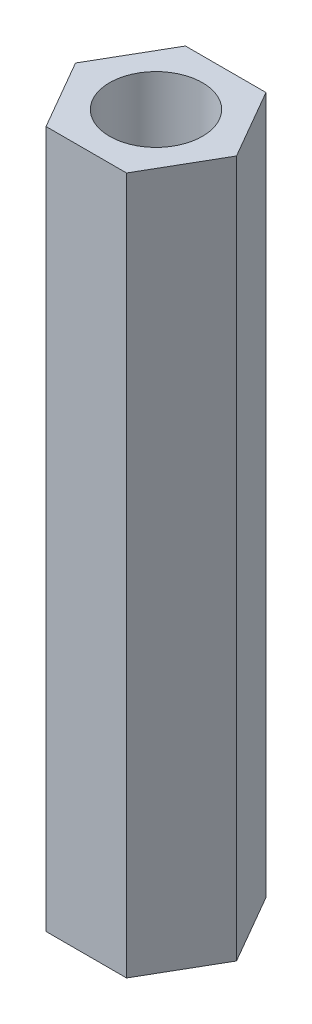
ISO-10303-21;
HEADER;
FILE_DESCRIPTION(('STEP AP214'),'2;1');
FILE_NAME('part.step','',(''),(''),'','','');
FILE_SCHEMA(('AUTOMOTIVE_DESIGN { 1 0 10303 214 1 1 1 1 }'));
ENDSEC;
DATA;
#1=APPLICATION_CONTEXT('core data for automotive mechanical design processes');
#2=APPLICATION_PROTOCOL_DEFINITION('international standard','automotive_design',2000,#1);
#3=PRODUCT_CONTEXT('',#1,'mechanical');
#4=PRODUCT('Part','Part','',(#3));
#5=PRODUCT_RELATED_PRODUCT_CATEGORY('part','',(#4));
#6=PRODUCT_DEFINITION_FORMATION('','',#4);
#7=PRODUCT_DEFINITION_CONTEXT('part definition',#1,'design');
#8=PRODUCT_DEFINITION('design','',#6,#7);
#9=PRODUCT_DEFINITION_SHAPE('','',#8);
#10=(LENGTH_UNIT() NAMED_UNIT(*) SI_UNIT(.MILLI.,.METRE.));
#11=(NAMED_UNIT(*) PLANE_ANGLE_UNIT() SI_UNIT($,.RADIAN.));
#12=(NAMED_UNIT(*) SI_UNIT($,.STERADIAN.) SOLID_ANGLE_UNIT());
#13=UNCERTAINTY_MEASURE_WITH_UNIT(LENGTH_MEASURE(1.E-05),#10,'distance_accuracy_value','');
#14=(GEOMETRIC_REPRESENTATION_CONTEXT(3) GLOBAL_UNCERTAINTY_ASSIGNED_CONTEXT((#13)) GLOBAL_UNIT_ASSIGNED_CONTEXT((#10,
#11,#12)) REPRESENTATION_CONTEXT('',''));
#15=CARTESIAN_POINT('',(0.,0.,0.));
#16=DIRECTION('',(0.,0.,1.));
#17=DIRECTION('',(1.,0.,0.));
#18=AXIS2_PLACEMENT_3D('',#15,#16,#17);
#19=CARTESIAN_POINT('',(0.,30.,0.));
#20=DIRECTION('',(0.,1.,0.));
#21=DIRECTION('',(0.,0.,1.));
#22=AXIS2_PLACEMENT_3D('',#19,#20,#21);
#23=PLANE('',#22);
#24=DIRECTION('',(-0.5,0.,-0.866025403784438));
#25=VECTOR('',#24,1.);
#26=CARTESIAN_POINT('',(3.46410161513775,30.,0.));
#27=LINE('',#26,#25);
#28=CARTESIAN_POINT('',(3.46410161513775,30.,0.));
#29=VERTEX_POINT('',#28);
#30=CARTESIAN_POINT('',(1.73205080756888,30.,-3.));
#31=VERTEX_POINT('',#30);
#32=EDGE_CURVE('E133',#29,#31,#27,.T.);
#33=ORIENTED_EDGE('',*,*,#32,.T.);
#34=DIRECTION('',(-1.,0.,0.));
#35=VECTOR('',#34,1.);
#36=CARTESIAN_POINT('',(1.73205080756888,30.,-3.));
#37=LINE('',#36,#35);
#38=CARTESIAN_POINT('',(-1.73205080756888,30.,-3.));
#39=VERTEX_POINT('',#38);
#40=EDGE_CURVE('E91',#31,#39,#37,.T.);
#41=ORIENTED_EDGE('',*,*,#40,.T.);
#42=DIRECTION('',(-0.499999999999999,0.,0.866025403784439));
#43=VECTOR('',#42,1.);
#44=CARTESIAN_POINT('',(-1.73205080756888,30.,-3.));
#45=LINE('',#44,#43);
#46=CARTESIAN_POINT('',(-3.46410161513775,30.,0.));
#47=VERTEX_POINT('',#46);
#48=EDGE_CURVE('E104',#39,#47,#45,.T.);
#49=ORIENTED_EDGE('',*,*,#48,.T.);
#50=DIRECTION('',(0.5,0.,0.866025403784438));
#51=VECTOR('',#50,1.);
#52=CARTESIAN_POINT('',(-3.46410161513775,30.,0.));
#53=LINE('',#52,#51);
#54=CARTESIAN_POINT('',(-1.73205080756888,30.,3.));
#55=VERTEX_POINT('',#54);
#56=EDGE_CURVE('E98',#47,#55,#53,.T.);
#57=ORIENTED_EDGE('',*,*,#56,.T.);
#58=DIRECTION('',(1.,0.,0.));
#59=VECTOR('',#58,1.);
#60=CARTESIAN_POINT('',(-1.73205080756888,30.,3.));
#61=LINE('',#60,#59);
#62=CARTESIAN_POINT('',(1.73205080756888,30.,3.));
#63=VERTEX_POINT('',#62);
#64=EDGE_CURVE('E102',#55,#63,#61,.T.);
#65=ORIENTED_EDGE('',*,*,#64,.T.);
#66=DIRECTION('',(0.5,0.,-0.866025403784439));
#67=VECTOR('',#66,1.);
#68=CARTESIAN_POINT('',(1.73205080756888,30.,3.));
#69=LINE('',#68,#67);
#70=EDGE_CURVE('E54',#63,#29,#69,.T.);
#71=ORIENTED_EDGE('',*,*,#70,.T.);
#72=EDGE_LOOP('',(#33,#41,#49,#57,#65,#71));
#73=FACE_BOUND('',#72,.T.);
#74=CARTESIAN_POINT('',(0.,30.,0.));
#75=DIRECTION('',(0.,1.,0.));
#76=DIRECTION('',(0.,0.,1.));
#77=AXIS2_PLACEMENT_3D('',#74,#75,#76);
#78=CIRCLE('',#77,2.);
#79=CARTESIAN_POINT('',(0.,30.,2.));
#80=VERTEX_POINT('',#79);
#81=EDGE_CURVE('E126',#80,#80,#78,.T.);
#82=ORIENTED_EDGE('',*,*,#81,.F.);
#83=EDGE_LOOP('',(#82));
#84=FACE_BOUND('',#83,.T.);
#85=ADVANCED_FACE('F37',(#73,#84),#23,.T.);
#86=CARTESIAN_POINT('',(0.,0.,0.));
#87=DIRECTION('',(0.,1.,0.));
#88=DIRECTION('',(0.,0.,1.));
#89=AXIS2_PLACEMENT_3D('',#86,#87,#88);
#90=PLANE('',#89);
#91=DIRECTION('',(-0.5,0.,-0.866025403784438));
#92=VECTOR('',#91,1.);
#93=CARTESIAN_POINT('',(3.46410161513775,0.,0.));
#94=LINE('',#93,#92);
#95=CARTESIAN_POINT('',(3.46410161513775,0.,0.));
#96=VERTEX_POINT('',#95);
#97=CARTESIAN_POINT('',(1.73205080756888,0.,-3.));
#98=VERTEX_POINT('',#97);
#99=EDGE_CURVE('E122',#96,#98,#94,.T.);
#100=ORIENTED_EDGE('',*,*,#99,.F.);
#101=DIRECTION('',(0.5,0.,-0.866025403784439));
#102=VECTOR('',#101,1.);
#103=CARTESIAN_POINT('',(1.73205080756888,0.,3.));
#104=LINE('',#103,#102);
#105=CARTESIAN_POINT('',(1.73205080756888,0.,3.));
#106=VERTEX_POINT('',#105);
#107=EDGE_CURVE('E83',#106,#96,#104,.T.);
#108=ORIENTED_EDGE('',*,*,#107,.F.);
#109=DIRECTION('',(1.,0.,0.));
#110=VECTOR('',#109,1.);
#111=CARTESIAN_POINT('',(-1.73205080756888,0.,3.));
#112=LINE('',#111,#110);
#113=CARTESIAN_POINT('',(-1.73205080756888,0.,3.));
#114=VERTEX_POINT('',#113);
#115=EDGE_CURVE('E77',#114,#106,#112,.T.);
#116=ORIENTED_EDGE('',*,*,#115,.F.);
#117=DIRECTION('',(0.5,0.,0.866025403784438));
#118=VECTOR('',#117,1.);
#119=CARTESIAN_POINT('',(-3.46410161513775,0.,0.));
#120=LINE('',#119,#118);
#121=CARTESIAN_POINT('',(-3.46410161513775,0.,0.));
#122=VERTEX_POINT('',#121);
#123=EDGE_CURVE('E112',#122,#114,#120,.T.);
#124=ORIENTED_EDGE('',*,*,#123,.F.);
#125=DIRECTION('',(-0.499999999999999,0.,0.866025403784439));
#126=VECTOR('',#125,1.);
#127=CARTESIAN_POINT('',(-1.73205080756888,0.,-3.));
#128=LINE('',#127,#126);
#129=CARTESIAN_POINT('',(-1.73205080756888,0.,-3.));
#130=VERTEX_POINT('',#129);
#131=EDGE_CURVE('E128',#130,#122,#128,.T.);
#132=ORIENTED_EDGE('',*,*,#131,.F.);
#133=DIRECTION('',(-1.,0.,0.));
#134=VECTOR('',#133,1.);
#135=CARTESIAN_POINT('',(1.73205080756888,0.,-3.));
#136=LINE('',#135,#134);
#137=EDGE_CURVE('E125',#98,#130,#136,.T.);
#138=ORIENTED_EDGE('',*,*,#137,.F.);
#139=EDGE_LOOP('',(#100,#108,#116,#124,#132,#138));
#140=FACE_BOUND('',#139,.T.);
#141=CARTESIAN_POINT('',(0.,0.,0.));
#142=DIRECTION('',(0.,1.,0.));
#143=DIRECTION('',(0.,0.,1.));
#144=AXIS2_PLACEMENT_3D('',#141,#142,#143);
#145=CIRCLE('',#144,2.);
#146=CARTESIAN_POINT('',(0.,0.,2.));
#147=VERTEX_POINT('',#146);
#148=EDGE_CURVE('E226',#147,#147,#145,.T.);
#149=ORIENTED_EDGE('',*,*,#148,.T.);
#150=EDGE_LOOP('',(#149));
#151=FACE_BOUND('',#150,.T.);
#152=ADVANCED_FACE('F142',(#140,#151),#90,.F.);
#153=CARTESIAN_POINT('',(3.46410161513775,30.,0.));
#154=DIRECTION('',(-0.866025403784438,0.,0.5));
#155=DIRECTION('',(0.5,0.,0.866025403784438));
#156=AXIS2_PLACEMENT_3D('',#153,#154,#155);
#157=PLANE('',#156);
#158=ORIENTED_EDGE('',*,*,#99,.T.);
#159=DIRECTION('',(0.,-1.,0.));
#160=VECTOR('',#159,1.);
#161=CARTESIAN_POINT('',(1.73205080756888,30.,-3.));
#162=LINE('',#161,#160);
#163=EDGE_CURVE('E11',#31,#98,#162,.T.);
#164=ORIENTED_EDGE('',*,*,#163,.F.);
#165=ORIENTED_EDGE('',*,*,#32,.F.);
#166=DIRECTION('',(0.,-1.,0.));
#167=VECTOR('',#166,1.);
#168=CARTESIAN_POINT('',(3.46410161513775,30.,0.));
#169=LINE('',#168,#167);
#170=EDGE_CURVE('E118',#29,#96,#169,.T.);
#171=ORIENTED_EDGE('',*,*,#170,.T.);
#172=EDGE_LOOP('',(#158,#164,#165,#171));
#173=FACE_BOUND('',#172,.T.);
#174=ADVANCED_FACE('F39',(#173),#157,.F.);
#175=CARTESIAN_POINT('',(1.73205080756888,30.,-3.));
#176=DIRECTION('',(0.,0.,1.));
#177=DIRECTION('',(1.,0.,0.));
#178=AXIS2_PLACEMENT_3D('',#175,#176,#177);
#179=PLANE('',#178);
#180=ORIENTED_EDGE('',*,*,#137,.T.);
#181=DIRECTION('',(0.,-1.,0.));
#182=VECTOR('',#181,1.);
#183=CARTESIAN_POINT('',(-1.73205080756888,30.,-3.));
#184=LINE('',#183,#182);
#185=EDGE_CURVE('E46',#39,#130,#184,.T.);
#186=ORIENTED_EDGE('',*,*,#185,.F.);
#187=ORIENTED_EDGE('',*,*,#40,.F.);
#188=ORIENTED_EDGE('',*,*,#163,.T.);
#189=EDGE_LOOP('',(#180,#186,#187,#188));
#190=FACE_BOUND('',#189,.T.);
#191=ADVANCED_FACE('F167',(#190),#179,.F.);
#192=CARTESIAN_POINT('',(-1.73205080756888,30.,-3.));
#193=DIRECTION('',(0.866025403784439,0.,0.499999999999999));
#194=DIRECTION('',(0.5,0.,-0.866025403784439));
#195=AXIS2_PLACEMENT_3D('',#192,#193,#194);
#196=PLANE('',#195);
#197=ORIENTED_EDGE('',*,*,#131,.T.);
#198=DIRECTION('',(0.,-1.,0.));
#199=VECTOR('',#198,1.);
#200=CARTESIAN_POINT('',(-3.46410161513775,30.,0.));
#201=LINE('',#200,#199);
#202=EDGE_CURVE('E113',#47,#122,#201,.T.);
#203=ORIENTED_EDGE('',*,*,#202,.F.);
#204=ORIENTED_EDGE('',*,*,#48,.F.);
#205=ORIENTED_EDGE('',*,*,#185,.T.);
#206=EDGE_LOOP('',(#197,#203,#204,#205));
#207=FACE_BOUND('',#206,.T.);
#208=ADVANCED_FACE('F139',(#207),#196,.F.);
#209=CARTESIAN_POINT('',(-3.46410161513775,30.,0.));
#210=DIRECTION('',(0.866025403784438,0.,-0.5));
#211=DIRECTION('',(-0.5,0.,-0.866025403784439));
#212=AXIS2_PLACEMENT_3D('',#209,#210,#211);
#213=PLANE('',#212);
#214=ORIENTED_EDGE('',*,*,#123,.T.);
#215=DIRECTION('',(0.,-1.,0.));
#216=VECTOR('',#215,1.);
#217=CARTESIAN_POINT('',(-1.73205080756888,30.,3.));
#218=LINE('',#217,#216);
#219=EDGE_CURVE('E109',#55,#114,#218,.T.);
#220=ORIENTED_EDGE('',*,*,#219,.F.);
#221=ORIENTED_EDGE('',*,*,#56,.F.);
#222=ORIENTED_EDGE('',*,*,#202,.T.);
#223=EDGE_LOOP('',(#214,#220,#221,#222));
#224=FACE_BOUND('',#223,.T.);
#225=ADVANCED_FACE('F110',(#224),#213,.F.);
#226=CARTESIAN_POINT('',(-1.73205080756888,30.,3.));
#227=DIRECTION('',(0.,0.,-1.));
#228=DIRECTION('',(-1.,0.,0.));
#229=AXIS2_PLACEMENT_3D('',#226,#227,#228);
#230=PLANE('',#229);
#231=ORIENTED_EDGE('',*,*,#115,.T.);
#232=DIRECTION('',(0.,-1.,0.));
#233=VECTOR('',#232,1.);
#234=CARTESIAN_POINT('',(1.73205080756888,30.,3.));
#235=LINE('',#234,#233);
#236=EDGE_CURVE('E114',#63,#106,#235,.T.);
#237=ORIENTED_EDGE('',*,*,#236,.F.);
#238=ORIENTED_EDGE('',*,*,#64,.F.);
#239=ORIENTED_EDGE('',*,*,#219,.T.);
#240=EDGE_LOOP('',(#231,#237,#238,#239));
#241=FACE_BOUND('',#240,.T.);
#242=ADVANCED_FACE('F116',(#241),#230,.F.);
#243=CARTESIAN_POINT('',(1.73205080756888,30.,3.));
#244=DIRECTION('',(-0.866025403784439,0.,-0.5));
#245=DIRECTION('',(-0.5,0.,0.866025403784439));
#246=AXIS2_PLACEMENT_3D('',#243,#244,#245);
#247=PLANE('',#246);
#248=ORIENTED_EDGE('',*,*,#107,.T.);
#249=ORIENTED_EDGE('',*,*,#170,.F.);
#250=ORIENTED_EDGE('',*,*,#70,.F.);
#251=ORIENTED_EDGE('',*,*,#236,.T.);
#252=EDGE_LOOP('',(#248,#249,#250,#251));
#253=FACE_BOUND('',#252,.T.);
#254=ADVANCED_FACE('F147',(#253),#247,.F.);
#255=CARTESIAN_POINT('',(0.,30.,0.));
#256=DIRECTION('',(0.,-1.,0.));
#257=DIRECTION('',(0.,0.,-1.));
#258=AXIS2_PLACEMENT_3D('',#255,#256,#257);
#259=CYLINDRICAL_SURFACE('',#258,2.);
#260=ORIENTED_EDGE('',*,*,#81,.T.);
#261=EDGE_LOOP('',(#260));
#262=FACE_BOUND('',#261,.T.);
#263=ORIENTED_EDGE('',*,*,#148,.F.);
#264=EDGE_LOOP('',(#263));
#265=FACE_BOUND('',#264,.T.);
#266=ADVANCED_FACE('F149',(#262,#265),#259,.F.);
#267=CLOSED_SHELL('',(#85,#152,#174,#191,#208,#225,#242,#254,#266));
#268=MANIFOLD_SOLID_BREP('B2',#267);
#269=ADVANCED_BREP_SHAPE_REPRESENTATION('',(#18,#268),#14);
#270=SHAPE_DEFINITION_REPRESENTATION(#9,#269);
ENDSEC;
END-ISO-10303-21;
